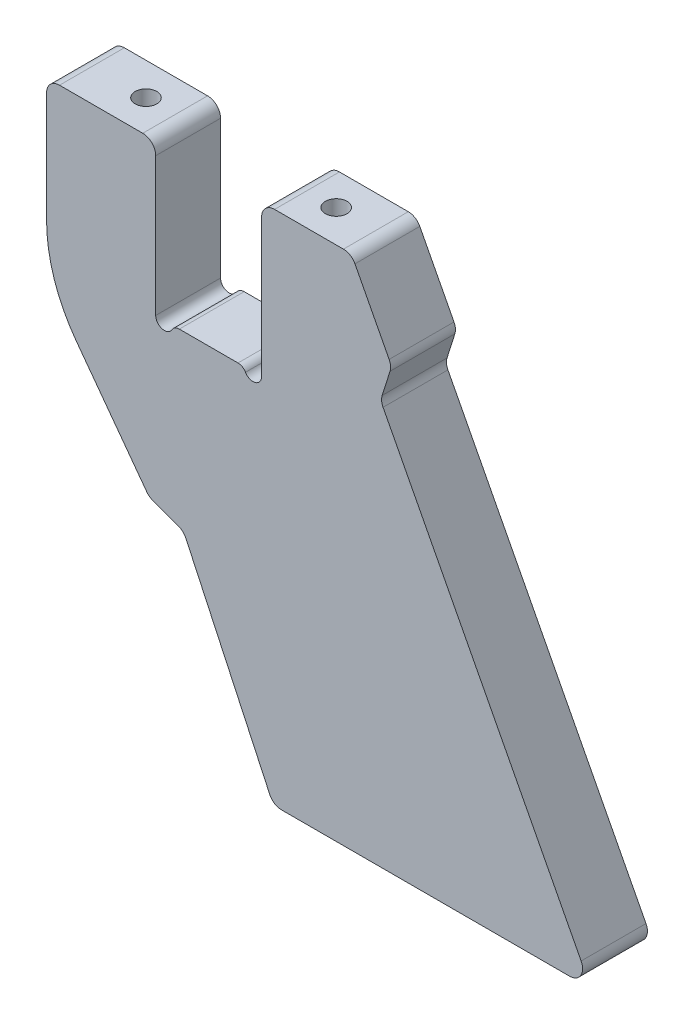
ISO-10303-21;
HEADER;
FILE_DESCRIPTION(('STEP AP214'),'2;1');
FILE_NAME('part.step','',(''),(''),'','','');
FILE_SCHEMA(('AUTOMOTIVE_DESIGN { 1 0 10303 214 1 1 1 1 }'));
ENDSEC;
DATA;
#1=APPLICATION_CONTEXT('core data for automotive mechanical design processes');
#2=APPLICATION_PROTOCOL_DEFINITION('international standard','automotive_design',2000,#1);
#3=PRODUCT_CONTEXT('',#1,'mechanical');
#4=PRODUCT('Part','Part','',(#3));
#5=PRODUCT_RELATED_PRODUCT_CATEGORY('part','',(#4));
#6=PRODUCT_DEFINITION_FORMATION('','',#4);
#7=PRODUCT_DEFINITION_CONTEXT('part definition',#1,'design');
#8=PRODUCT_DEFINITION('design','',#6,#7);
#9=PRODUCT_DEFINITION_SHAPE('','',#8);
#10=(LENGTH_UNIT() NAMED_UNIT(*) SI_UNIT(.MILLI.,.METRE.));
#11=(NAMED_UNIT(*) PLANE_ANGLE_UNIT() SI_UNIT($,.RADIAN.));
#12=(NAMED_UNIT(*) SI_UNIT($,.STERADIAN.) SOLID_ANGLE_UNIT());
#13=UNCERTAINTY_MEASURE_WITH_UNIT(LENGTH_MEASURE(1.E-05),#10,'distance_accuracy_value','');
#14=(GEOMETRIC_REPRESENTATION_CONTEXT(3) GLOBAL_UNCERTAINTY_ASSIGNED_CONTEXT((#13)) GLOBAL_UNIT_ASSIGNED_CONTEXT((#10,
#11,#12)) REPRESENTATION_CONTEXT('',''));
#15=CARTESIAN_POINT('',(0.,0.,0.));
#16=DIRECTION('',(0.,0.,1.));
#17=DIRECTION('',(1.,0.,0.));
#18=AXIS2_PLACEMENT_3D('',#15,#16,#17);
#19=CARTESIAN_POINT('',(31.1795553110562,32.,15.));
#20=DIRECTION('',(0.,0.,-1.));
#21=DIRECTION('',(-1.,0.,0.));
#22=AXIS2_PLACEMENT_3D('',#19,#20,#21);
#23=CYLINDRICAL_SURFACE('',#22,3.00000000000001);
#24=CARTESIAN_POINT('',(31.1795553110562,32.,0.));
#25=DIRECTION('',(0.,0.,1.));
#26=DIRECTION('',(1.,0.,0.));
#27=AXIS2_PLACEMENT_3D('',#24,#25,#26);
#28=CIRCLE('',#27,3.00000000000001);
#29=CARTESIAN_POINT('',(33.8405878105909,33.3852458397051,0.));
#30=VERTEX_POINT('',#29);
#31=CARTESIAN_POINT('',(31.1795553110562,35.,0.));
#32=VERTEX_POINT('',#31);
#33=EDGE_CURVE('E268',#30,#32,#28,.T.);
#34=ORIENTED_EDGE('',*,*,#33,.T.);
#35=DIRECTION('',(0.,0.,-1.));
#36=VECTOR('',#35,1.);
#37=CARTESIAN_POINT('',(31.1795553110562,35.,15.));
#38=LINE('',#37,#36);
#39=CARTESIAN_POINT('',(31.1795553110562,35.,15.));
#40=VERTEX_POINT('',#39);
#41=EDGE_CURVE('E11',#40,#32,#38,.T.);
#42=ORIENTED_EDGE('',*,*,#41,.F.);
#43=CARTESIAN_POINT('',(31.1795553110562,32.,15.));
#44=DIRECTION('',(0.,0.,1.));
#45=DIRECTION('',(1.,0.,0.));
#46=AXIS2_PLACEMENT_3D('',#43,#44,#45);
#47=CIRCLE('',#46,3.00000000000001);
#48=CARTESIAN_POINT('',(33.8405878105909,33.3852458397051,15.));
#49=VERTEX_POINT('',#48);
#50=EDGE_CURVE('E323',#49,#40,#47,.T.);
#51=ORIENTED_EDGE('',*,*,#50,.F.);
#52=DIRECTION('',(0.,0.,-1.));
#53=VECTOR('',#52,1.);
#54=CARTESIAN_POINT('',(33.8405878105909,33.3852458397051,15.));
#55=LINE('',#54,#53);
#56=EDGE_CURVE('E264',#49,#30,#55,.T.);
#57=ORIENTED_EDGE('',*,*,#56,.T.);
#58=EDGE_LOOP('',(#34,#42,#51,#57));
#59=FACE_BOUND('',#58,.T.);
#60=ADVANCED_FACE('F49',(#59),#23,.T.);
#61=CARTESIAN_POINT('',(15.25,35.,15.));
#62=DIRECTION('',(0.,-1.,0.));
#63=DIRECTION('',(1.,0.,0.));
#64=AXIS2_PLACEMENT_3D('',#61,#62,#63);
#65=PLANE('',#64);
#66=CARTESIAN_POINT('',(22.,35.,7.50000000000001));
#67=DIRECTION('',(0.,1.,0.));
#68=DIRECTION('',(0.,0.,1.));
#69=AXIS2_PLACEMENT_3D('',#66,#67,#68);
#70=CIRCLE('',#69,2.5);
#71=CARTESIAN_POINT('',(22.,35.,10.));
#72=VERTEX_POINT('',#71);
#73=EDGE_CURVE('E647',#72,#72,#70,.T.);
#74=ORIENTED_EDGE('',*,*,#73,.F.);
#75=EDGE_LOOP('',(#74));
#76=FACE_BOUND('',#75,.T.);
#77=DIRECTION('',(-1.,0.,0.));
#78=VECTOR('',#77,1.);
#79=CARTESIAN_POINT('',(15.25,35.,0.));
#80=LINE('',#79,#78);
#81=CARTESIAN_POINT('',(15.25,35.,0.));
#82=VERTEX_POINT('',#81);
#83=EDGE_CURVE('E271',#32,#82,#80,.T.);
#84=ORIENTED_EDGE('',*,*,#83,.T.);
#85=DIRECTION('',(0.,0.,-1.));
#86=VECTOR('',#85,1.);
#87=CARTESIAN_POINT('',(15.25,35.,15.));
#88=LINE('',#87,#86);
#89=CARTESIAN_POINT('',(15.25,35.,15.));
#90=VERTEX_POINT('',#89);
#91=EDGE_CURVE('E57',#90,#82,#88,.T.);
#92=ORIENTED_EDGE('',*,*,#91,.F.);
#93=DIRECTION('',(-1.,0.,0.));
#94=VECTOR('',#93,1.);
#95=CARTESIAN_POINT('',(15.25,35.,15.));
#96=LINE('',#95,#94);
#97=EDGE_CURVE('E169',#40,#90,#96,.T.);
#98=ORIENTED_EDGE('',*,*,#97,.F.);
#99=ORIENTED_EDGE('',*,*,#41,.T.);
#100=EDGE_LOOP('',(#84,#92,#98,#99));
#101=FACE_BOUND('',#100,.T.);
#102=ADVANCED_FACE('F481',(#76,#101),#65,.F.);
#103=CARTESIAN_POINT('',(15.25,32.,15.));
#104=DIRECTION('',(0.,0.,-1.));
#105=DIRECTION('',(-1.,0.,0.));
#106=AXIS2_PLACEMENT_3D('',#103,#104,#105);
#107=CYLINDRICAL_SURFACE('',#106,3.);
#108=CARTESIAN_POINT('',(15.25,32.,0.));
#109=DIRECTION('',(0.,0.,1.));
#110=DIRECTION('',(-1.,0.,0.));
#111=AXIS2_PLACEMENT_3D('',#108,#109,#110);
#112=CIRCLE('',#111,3.);
#113=CARTESIAN_POINT('',(12.25,32.,0.));
#114=VERTEX_POINT('',#113);
#115=EDGE_CURVE('E274',#82,#114,#112,.T.);
#116=ORIENTED_EDGE('',*,*,#115,.T.);
#117=DIRECTION('',(0.,0.,-1.));
#118=VECTOR('',#117,1.);
#119=CARTESIAN_POINT('',(12.25,32.,15.));
#120=LINE('',#119,#118);
#121=CARTESIAN_POINT('',(12.25,32.,15.));
#122=VERTEX_POINT('',#121);
#123=EDGE_CURVE('E390',#122,#114,#120,.T.);
#124=ORIENTED_EDGE('',*,*,#123,.F.);
#125=CARTESIAN_POINT('',(15.25,32.,15.));
#126=DIRECTION('',(0.,0.,1.));
#127=DIRECTION('',(-1.,0.,0.));
#128=AXIS2_PLACEMENT_3D('',#125,#126,#127);
#129=CIRCLE('',#128,3.);
#130=EDGE_CURVE('E398',#90,#122,#129,.T.);
#131=ORIENTED_EDGE('',*,*,#130,.F.);
#132=ORIENTED_EDGE('',*,*,#91,.T.);
#133=EDGE_LOOP('',(#116,#124,#131,#132));
#134=FACE_BOUND('',#133,.T.);
#135=ADVANCED_FACE('F396',(#134),#107,.T.);
#136=CARTESIAN_POINT('',(12.25,0.,15.));
#137=DIRECTION('',(1.,0.,0.));
#138=DIRECTION('',(0.,0.,-1.));
#139=AXIS2_PLACEMENT_3D('',#136,#137,#138);
#140=PLANE('',#139);
#141=DIRECTION('',(0.,-1.,0.));
#142=VECTOR('',#141,1.);
#143=CARTESIAN_POINT('',(12.25,0.,0.));
#144=LINE('',#143,#142);
#145=CARTESIAN_POINT('',(12.25,0.,0.));
#146=VERTEX_POINT('',#145);
#147=EDGE_CURVE('E276',#114,#146,#144,.T.);
#148=ORIENTED_EDGE('',*,*,#147,.T.);
#149=DIRECTION('',(0.,0.,-1.));
#150=VECTOR('',#149,1.);
#151=CARTESIAN_POINT('',(12.25,0.,15.));
#152=LINE('',#151,#150);
#153=CARTESIAN_POINT('',(12.25,0.,15.));
#154=VERTEX_POINT('',#153);
#155=EDGE_CURVE('E387',#154,#146,#152,.T.);
#156=ORIENTED_EDGE('',*,*,#155,.F.);
#157=DIRECTION('',(0.,-1.,0.));
#158=VECTOR('',#157,1.);
#159=CARTESIAN_POINT('',(12.25,0.,15.));
#160=LINE('',#159,#158);
#161=EDGE_CURVE('E416',#122,#154,#160,.T.);
#162=ORIENTED_EDGE('',*,*,#161,.F.);
#163=ORIENTED_EDGE('',*,*,#123,.T.);
#164=EDGE_LOOP('',(#148,#156,#162,#163));
#165=FACE_BOUND('',#164,.T.);
#166=ADVANCED_FACE('F407',(#165),#140,.F.);
#167=CARTESIAN_POINT('',(10.25,0.,15.));
#168=DIRECTION('',(0.,0.,-1.));
#169=DIRECTION('',(-1.,0.,0.));
#170=AXIS2_PLACEMENT_3D('',#167,#168,#169);
#171=CYLINDRICAL_SURFACE('',#170,2.);
#172=CARTESIAN_POINT('',(10.25,0.,0.));
#173=DIRECTION('',(0.,0.,-1.));
#174=DIRECTION('',(-1.,0.,0.));
#175=AXIS2_PLACEMENT_3D('',#172,#173,#174);
#176=CIRCLE('',#175,2.);
#177=CARTESIAN_POINT('',(8.51794919243112,-0.999999999999994,0.));
#178=VERTEX_POINT('',#177);
#179=EDGE_CURVE('E278',#146,#178,#176,.T.);
#180=ORIENTED_EDGE('',*,*,#179,.T.);
#181=DIRECTION('',(0.,0.,-1.));
#182=VECTOR('',#181,1.);
#183=CARTESIAN_POINT('',(8.51794919243112,-0.999999999999987,15.));
#184=LINE('',#183,#182);
#185=CARTESIAN_POINT('',(8.51794919243112,-0.999999999999987,15.));
#186=VERTEX_POINT('',#185);
#187=EDGE_CURVE('E384',#186,#178,#184,.T.);
#188=ORIENTED_EDGE('',*,*,#187,.F.);
#189=CARTESIAN_POINT('',(10.25,0.,15.));
#190=DIRECTION('',(0.,0.,-1.));
#191=DIRECTION('',(-1.,0.,0.));
#192=AXIS2_PLACEMENT_3D('',#189,#190,#191);
#193=CIRCLE('',#192,2.);
#194=EDGE_CURVE('E413',#154,#186,#193,.T.);
#195=ORIENTED_EDGE('',*,*,#194,.F.);
#196=ORIENTED_EDGE('',*,*,#155,.T.);
#197=EDGE_LOOP('',(#180,#188,#195,#196));
#198=FACE_BOUND('',#197,.T.);
#199=ADVANCED_FACE('F411',(#198),#171,.F.);
#200=CARTESIAN_POINT('',(6.78589838486225,-1.99999999999999,15.));
#201=DIRECTION('',(0.,0.,-1.));
#202=DIRECTION('',(-1.,0.,0.));
#203=AXIS2_PLACEMENT_3D('',#200,#201,#202);
#204=CYLINDRICAL_SURFACE('',#203,2.);
#205=CARTESIAN_POINT('',(6.78589838486225,-1.99999999999999,0.));
#206=DIRECTION('',(0.,0.,1.));
#207=DIRECTION('',(1.,0.,0.));
#208=AXIS2_PLACEMENT_3D('',#205,#206,#207);
#209=CIRCLE('',#208,2.);
#210=CARTESIAN_POINT('',(6.78589838486225,0.,0.));
#211=VERTEX_POINT('',#210);
#212=EDGE_CURVE('E280',#178,#211,#209,.T.);
#213=ORIENTED_EDGE('',*,*,#212,.T.);
#214=DIRECTION('',(0.,0.,-1.));
#215=VECTOR('',#214,1.);
#216=CARTESIAN_POINT('',(6.78589838486225,0.,15.));
#217=LINE('',#216,#215);
#218=CARTESIAN_POINT('',(6.78589838486225,0.,15.));
#219=VERTEX_POINT('',#218);
#220=EDGE_CURVE('E381',#219,#211,#217,.T.);
#221=ORIENTED_EDGE('',*,*,#220,.F.);
#222=CARTESIAN_POINT('',(6.78589838486225,-1.99999999999999,15.));
#223=DIRECTION('',(0.,0.,1.));
#224=DIRECTION('',(1.,0.,0.));
#225=AXIS2_PLACEMENT_3D('',#222,#223,#224);
#226=CIRCLE('',#225,2.);
#227=EDGE_CURVE('E415',#186,#219,#226,.T.);
#228=ORIENTED_EDGE('',*,*,#227,.F.);
#229=ORIENTED_EDGE('',*,*,#187,.T.);
#230=EDGE_LOOP('',(#213,#221,#228,#229));
#231=FACE_BOUND('',#230,.T.);
#232=ADVANCED_FACE('F496',(#231),#204,.T.);
#233=CARTESIAN_POINT('',(-6.78589838486224,0.,15.));
#234=DIRECTION('',(0.,-1.,0.));
#235=DIRECTION('',(0.,0.,-1.));
#236=AXIS2_PLACEMENT_3D('',#233,#234,#235);
#237=PLANE('',#236);
#238=DIRECTION('',(-1.,0.,0.));
#239=VECTOR('',#238,1.);
#240=CARTESIAN_POINT('',(-6.78589838486225,0.,0.));
#241=LINE('',#240,#239);
#242=CARTESIAN_POINT('',(-6.78589838486225,0.,0.));
#243=VERTEX_POINT('',#242);
#244=EDGE_CURVE('E282',#211,#243,#241,.T.);
#245=ORIENTED_EDGE('',*,*,#244,.T.);
#246=DIRECTION('',(0.,0.,-1.));
#247=VECTOR('',#246,1.);
#248=CARTESIAN_POINT('',(-6.78589838486224,0.,15.));
#249=LINE('',#248,#247);
#250=CARTESIAN_POINT('',(-6.78589838486224,0.,15.));
#251=VERTEX_POINT('',#250);
#252=EDGE_CURVE('E378',#251,#243,#249,.T.);
#253=ORIENTED_EDGE('',*,*,#252,.F.);
#254=DIRECTION('',(-1.,0.,0.));
#255=VECTOR('',#254,1.);
#256=CARTESIAN_POINT('',(-6.78589838486224,0.,15.));
#257=LINE('',#256,#255);
#258=EDGE_CURVE('E418',#219,#251,#257,.T.);
#259=ORIENTED_EDGE('',*,*,#258,.F.);
#260=ORIENTED_EDGE('',*,*,#220,.T.);
#261=EDGE_LOOP('',(#245,#253,#259,#260));
#262=FACE_BOUND('',#261,.T.);
#263=ADVANCED_FACE('F499',(#262),#237,.F.);
#264=CARTESIAN_POINT('',(-6.78589838486224,-1.99999999999999,15.));
#265=DIRECTION('',(0.,0.,-1.));
#266=DIRECTION('',(-1.,0.,0.));
#267=AXIS2_PLACEMENT_3D('',#264,#265,#266);
#268=CYLINDRICAL_SURFACE('',#267,2.);
#269=CARTESIAN_POINT('',(-6.78589838486225,-1.99999999999999,0.));
#270=DIRECTION('',(0.,0.,1.));
#271=DIRECTION('',(-1.,0.,0.));
#272=AXIS2_PLACEMENT_3D('',#269,#270,#271);
#273=CIRCLE('',#272,2.);
#274=CARTESIAN_POINT('',(-8.51794919243112,-0.999999999999994,0.));
#275=VERTEX_POINT('',#274);
#276=EDGE_CURVE('E284',#243,#275,#273,.T.);
#277=ORIENTED_EDGE('',*,*,#276,.T.);
#278=DIRECTION('',(0.,0.,-1.));
#279=VECTOR('',#278,1.);
#280=CARTESIAN_POINT('',(-8.51794919243112,-0.999999999999987,15.));
#281=LINE('',#280,#279);
#282=CARTESIAN_POINT('',(-8.51794919243112,-0.999999999999987,15.));
#283=VERTEX_POINT('',#282);
#284=EDGE_CURVE('E375',#283,#275,#281,.T.);
#285=ORIENTED_EDGE('',*,*,#284,.F.);
#286=CARTESIAN_POINT('',(-6.78589838486224,-1.99999999999999,15.));
#287=DIRECTION('',(0.,0.,1.));
#288=DIRECTION('',(-1.,0.,0.));
#289=AXIS2_PLACEMENT_3D('',#286,#287,#288);
#290=CIRCLE('',#289,2.);
#291=EDGE_CURVE('E424',#251,#283,#290,.T.);
#292=ORIENTED_EDGE('',*,*,#291,.F.);
#293=ORIENTED_EDGE('',*,*,#252,.T.);
#294=EDGE_LOOP('',(#277,#285,#292,#293));
#295=FACE_BOUND('',#294,.T.);
#296=ADVANCED_FACE('F503',(#295),#268,.T.);
#297=CARTESIAN_POINT('',(-10.25,0.,15.));
#298=DIRECTION('',(0.,0.,-1.));
#299=DIRECTION('',(-1.,0.,0.));
#300=AXIS2_PLACEMENT_3D('',#297,#298,#299);
#301=CYLINDRICAL_SURFACE('',#300,2.);
#302=CARTESIAN_POINT('',(-10.25,0.,0.));
#303=DIRECTION('',(0.,0.,-1.));
#304=DIRECTION('',(1.,0.,0.));
#305=AXIS2_PLACEMENT_3D('',#302,#303,#304);
#306=CIRCLE('',#305,2.);
#307=CARTESIAN_POINT('',(-12.25,0.,0.));
#308=VERTEX_POINT('',#307);
#309=EDGE_CURVE('E286',#275,#308,#306,.T.);
#310=ORIENTED_EDGE('',*,*,#309,.T.);
#311=DIRECTION('',(0.,0.,-1.));
#312=VECTOR('',#311,1.);
#313=CARTESIAN_POINT('',(-12.25,0.,15.));
#314=LINE('',#313,#312);
#315=CARTESIAN_POINT('',(-12.25,0.,15.));
#316=VERTEX_POINT('',#315);
#317=EDGE_CURVE('E372',#316,#308,#314,.T.);
#318=ORIENTED_EDGE('',*,*,#317,.F.);
#319=CARTESIAN_POINT('',(-10.25,0.,15.));
#320=DIRECTION('',(0.,0.,-1.));
#321=DIRECTION('',(1.,0.,0.));
#322=AXIS2_PLACEMENT_3D('',#319,#320,#321);
#323=CIRCLE('',#322,2.);
#324=EDGE_CURVE('E426',#283,#316,#323,.T.);
#325=ORIENTED_EDGE('',*,*,#324,.F.);
#326=ORIENTED_EDGE('',*,*,#284,.T.);
#327=EDGE_LOOP('',(#310,#318,#325,#326));
#328=FACE_BOUND('',#327,.T.);
#329=ADVANCED_FACE('F507',(#328),#301,.F.);
#330=CARTESIAN_POINT('',(-12.25,0.,15.));
#331=DIRECTION('',(-1.,0.,0.));
#332=DIRECTION('',(0.,0.,1.));
#333=AXIS2_PLACEMENT_3D('',#330,#331,#332);
#334=PLANE('',#333);
#335=DIRECTION('',(0.,1.,0.));
#336=VECTOR('',#335,1.);
#337=CARTESIAN_POINT('',(-12.25,0.,0.));
#338=LINE('',#337,#336);
#339=CARTESIAN_POINT('',(-12.25,32.,0.));
#340=VERTEX_POINT('',#339);
#341=EDGE_CURVE('E288',#308,#340,#338,.T.);
#342=ORIENTED_EDGE('',*,*,#341,.T.);
#343=DIRECTION('',(0.,0.,-1.));
#344=VECTOR('',#343,1.);
#345=CARTESIAN_POINT('',(-12.25,32.,15.));
#346=LINE('',#345,#344);
#347=CARTESIAN_POINT('',(-12.25,32.,15.));
#348=VERTEX_POINT('',#347);
#349=EDGE_CURVE('E369',#348,#340,#346,.T.);
#350=ORIENTED_EDGE('',*,*,#349,.F.);
#351=DIRECTION('',(0.,1.,0.));
#352=VECTOR('',#351,1.);
#353=CARTESIAN_POINT('',(-12.25,0.,15.));
#354=LINE('',#353,#352);
#355=EDGE_CURVE('E428',#316,#348,#354,.T.);
#356=ORIENTED_EDGE('',*,*,#355,.F.);
#357=ORIENTED_EDGE('',*,*,#317,.T.);
#358=EDGE_LOOP('',(#342,#350,#356,#357));
#359=FACE_BOUND('',#358,.T.);
#360=ADVANCED_FACE('F511',(#359),#334,.F.);
#361=CARTESIAN_POINT('',(-15.25,32.,15.));
#362=DIRECTION('',(0.,0.,-1.));
#363=DIRECTION('',(-1.,0.,0.));
#364=AXIS2_PLACEMENT_3D('',#361,#362,#363);
#365=CYLINDRICAL_SURFACE('',#364,3.);
#366=CARTESIAN_POINT('',(-15.25,32.,0.));
#367=DIRECTION('',(0.,0.,1.));
#368=DIRECTION('',(-1.,0.,0.));
#369=AXIS2_PLACEMENT_3D('',#366,#367,#368);
#370=CIRCLE('',#369,3.);
#371=CARTESIAN_POINT('',(-15.25,35.,0.));
#372=VERTEX_POINT('',#371);
#373=EDGE_CURVE('E290',#340,#372,#370,.T.);
#374=ORIENTED_EDGE('',*,*,#373,.T.);
#375=DIRECTION('',(0.,0.,-1.));
#376=VECTOR('',#375,1.);
#377=CARTESIAN_POINT('',(-15.25,35.,15.));
#378=LINE('',#377,#376);
#379=CARTESIAN_POINT('',(-15.25,35.,15.));
#380=VERTEX_POINT('',#379);
#381=EDGE_CURVE('E366',#380,#372,#378,.T.);
#382=ORIENTED_EDGE('',*,*,#381,.F.);
#383=CARTESIAN_POINT('',(-15.25,32.,15.));
#384=DIRECTION('',(0.,0.,1.));
#385=DIRECTION('',(-1.,0.,0.));
#386=AXIS2_PLACEMENT_3D('',#383,#384,#385);
#387=CIRCLE('',#386,3.);
#388=EDGE_CURVE('E430',#348,#380,#387,.T.);
#389=ORIENTED_EDGE('',*,*,#388,.F.);
#390=ORIENTED_EDGE('',*,*,#349,.T.);
#391=EDGE_LOOP('',(#374,#382,#389,#390));
#392=FACE_BOUND('',#391,.T.);
#393=ADVANCED_FACE('F515',(#392),#365,.T.);
#394=CARTESIAN_POINT('',(-15.25,35.,15.));
#395=DIRECTION('',(0.,-1.,0.));
#396=DIRECTION('',(1.,0.,0.));
#397=AXIS2_PLACEMENT_3D('',#394,#395,#396);
#398=PLANE('',#397);
#399=CARTESIAN_POINT('',(-22.,35.,7.49999999999999));
#400=DIRECTION('',(0.,1.,0.));
#401=DIRECTION('',(0.,0.,1.));
#402=AXIS2_PLACEMENT_3D('',#399,#400,#401);
#403=CIRCLE('',#402,2.5);
#404=CARTESIAN_POINT('',(-22.,35.,9.99999999999999));
#405=VERTEX_POINT('',#404);
#406=EDGE_CURVE('E649',#405,#405,#403,.T.);
#407=ORIENTED_EDGE('',*,*,#406,.F.);
#408=EDGE_LOOP('',(#407));
#409=FACE_BOUND('',#408,.T.);
#410=DIRECTION('',(-1.,0.,0.));
#411=VECTOR('',#410,1.);
#412=CARTESIAN_POINT('',(-15.25,35.,0.));
#413=LINE('',#412,#411);
#414=CARTESIAN_POINT('',(-34.5,35.,0.));
#415=VERTEX_POINT('',#414);
#416=EDGE_CURVE('E292',#372,#415,#413,.T.);
#417=ORIENTED_EDGE('',*,*,#416,.T.);
#418=DIRECTION('',(0.,0.,-1.));
#419=VECTOR('',#418,1.);
#420=CARTESIAN_POINT('',(-34.5,35.,15.));
#421=LINE('',#420,#419);
#422=CARTESIAN_POINT('',(-34.5,35.,15.));
#423=VERTEX_POINT('',#422);
#424=EDGE_CURVE('E363',#423,#415,#421,.T.);
#425=ORIENTED_EDGE('',*,*,#424,.F.);
#426=DIRECTION('',(-1.,0.,0.));
#427=VECTOR('',#426,1.);
#428=CARTESIAN_POINT('',(-15.25,35.,15.));
#429=LINE('',#428,#427);
#430=EDGE_CURVE('E432',#380,#423,#429,.T.);
#431=ORIENTED_EDGE('',*,*,#430,.F.);
#432=ORIENTED_EDGE('',*,*,#381,.T.);
#433=EDGE_LOOP('',(#417,#425,#431,#432));
#434=FACE_BOUND('',#433,.T.);
#435=ADVANCED_FACE('F519',(#409,#434),#398,.F.);
#436=CARTESIAN_POINT('',(-34.5,32.,15.));
#437=DIRECTION('',(0.,0.,-1.));
#438=DIRECTION('',(-1.,0.,0.));
#439=AXIS2_PLACEMENT_3D('',#436,#437,#438);
#440=CYLINDRICAL_SURFACE('',#439,3.);
#441=CARTESIAN_POINT('',(-34.5,32.,0.));
#442=DIRECTION('',(0.,0.,1.));
#443=DIRECTION('',(-1.,0.,0.));
#444=AXIS2_PLACEMENT_3D('',#441,#442,#443);
#445=CIRCLE('',#444,3.);
#446=CARTESIAN_POINT('',(-37.5,32.,0.));
#447=VERTEX_POINT('',#446);
#448=EDGE_CURVE('E294',#415,#447,#445,.T.);
#449=ORIENTED_EDGE('',*,*,#448,.T.);
#450=DIRECTION('',(0.,0.,-1.));
#451=VECTOR('',#450,1.);
#452=CARTESIAN_POINT('',(-37.5,32.,15.));
#453=LINE('',#452,#451);
#454=CARTESIAN_POINT('',(-37.5,32.,15.));
#455=VERTEX_POINT('',#454);
#456=EDGE_CURVE('E360',#455,#447,#453,.T.);
#457=ORIENTED_EDGE('',*,*,#456,.F.);
#458=CARTESIAN_POINT('',(-34.5,32.,15.));
#459=DIRECTION('',(0.,0.,1.));
#460=DIRECTION('',(-1.,0.,0.));
#461=AXIS2_PLACEMENT_3D('',#458,#459,#460);
#462=CIRCLE('',#461,3.);
#463=EDGE_CURVE('E434',#423,#455,#462,.T.);
#464=ORIENTED_EDGE('',*,*,#463,.F.);
#465=ORIENTED_EDGE('',*,*,#424,.T.);
#466=EDGE_LOOP('',(#449,#457,#464,#465));
#467=FACE_BOUND('',#466,.T.);
#468=ADVANCED_FACE('F523',(#467),#440,.T.);
#469=CARTESIAN_POINT('',(-37.5,6.52878625967986,15.));
#470=DIRECTION('',(1.,0.,0.));
#471=DIRECTION('',(0.,0.,-1.));
#472=AXIS2_PLACEMENT_3D('',#469,#470,#471);
#473=PLANE('',#472);
#474=DIRECTION('',(0.,-1.,0.));
#475=VECTOR('',#474,1.);
#476=CARTESIAN_POINT('',(-37.5,6.52878625967986,0.));
#477=LINE('',#476,#475);
#478=CARTESIAN_POINT('',(-37.5,6.52878625967986,0.));
#479=VERTEX_POINT('',#478);
#480=EDGE_CURVE('E296',#447,#479,#477,.T.);
#481=ORIENTED_EDGE('',*,*,#480,.T.);
#482=DIRECTION('',(0.,0.,-1.));
#483=VECTOR('',#482,1.);
#484=CARTESIAN_POINT('',(-37.5,6.52878625967986,15.));
#485=LINE('',#484,#483);
#486=CARTESIAN_POINT('',(-37.5,6.52878625967986,15.));
#487=VERTEX_POINT('',#486);
#488=EDGE_CURVE('E357',#487,#479,#485,.T.);
#489=ORIENTED_EDGE('',*,*,#488,.F.);
#490=DIRECTION('',(0.,-1.,0.));
#491=VECTOR('',#490,1.);
#492=CARTESIAN_POINT('',(-37.5,6.52878625967986,15.));
#493=LINE('',#492,#491);
#494=EDGE_CURVE('E436',#455,#487,#493,.T.);
#495=ORIENTED_EDGE('',*,*,#494,.F.);
#496=ORIENTED_EDGE('',*,*,#456,.T.);
#497=EDGE_LOOP('',(#481,#489,#495,#496));
#498=FACE_BOUND('',#497,.T.);
#499=ADVANCED_FACE('F527',(#498),#473,.F.);
#500=CARTESIAN_POINT('',(-2.5,6.52878625967986,15.));
#501=DIRECTION('',(0.,0.,-1.));
#502=DIRECTION('',(-1.,0.,0.));
#503=AXIS2_PLACEMENT_3D('',#500,#501,#502);
#504=CYLINDRICAL_SURFACE('',#503,35.);
#505=CARTESIAN_POINT('',(-2.49999999999999,6.52878625967986,0.));
#506=DIRECTION('',(0.,0.,1.));
#507=DIRECTION('',(-1.,0.,0.));
#508=AXIS2_PLACEMENT_3D('',#505,#506,#507);
#509=CIRCLE('',#508,35.);
#510=CARTESIAN_POINT('',(-30.6483795484822,-14.2719043248798,0.));
#511=VERTEX_POINT('',#510);
#512=EDGE_CURVE('E298',#479,#511,#509,.T.);
#513=ORIENTED_EDGE('',*,*,#512,.T.);
#514=DIRECTION('',(0.,0.,-1.));
#515=VECTOR('',#514,1.);
#516=CARTESIAN_POINT('',(-30.6483795484822,-14.2719043248798,15.));
#517=LINE('',#516,#515);
#518=CARTESIAN_POINT('',(-30.6483795484822,-14.2719043248798,15.));
#519=VERTEX_POINT('',#518);
#520=EDGE_CURVE('E354',#519,#511,#517,.T.);
#521=ORIENTED_EDGE('',*,*,#520,.F.);
#522=CARTESIAN_POINT('',(-2.5,6.52878625967986,15.));
#523=DIRECTION('',(0.,0.,1.));
#524=DIRECTION('',(-1.,0.,0.));
#525=AXIS2_PLACEMENT_3D('',#522,#523,#524);
#526=CIRCLE('',#525,35.);
#527=EDGE_CURVE('E438',#487,#519,#526,.T.);
#528=ORIENTED_EDGE('',*,*,#527,.F.);
#529=ORIENTED_EDGE('',*,*,#488,.T.);
#530=EDGE_LOOP('',(#513,#521,#528,#529));
#531=FACE_BOUND('',#530,.T.);
#532=ADVANCED_FACE('F531',(#531),#504,.T.);
#533=CARTESIAN_POINT('',(-30.6483795484822,-14.2719043248798,15.));
#534=DIRECTION('',(0.804239415670919,0.594305445273134,0.));
#535=DIRECTION('',(-0.594305445273134,0.804239415670919,0.));
#536=AXIS2_PLACEMENT_3D('',#533,#534,#535);
#537=PLANE('',#536);
#538=DIRECTION('',(0.594305445273134,-0.804239415670919,0.));
#539=VECTOR('',#538,1.);
#540=CARTESIAN_POINT('',(-30.6483795484822,-14.2719043248798,0.));
#541=LINE('',#540,#539);
#542=CARTESIAN_POINT('',(-14.3179987308344,-36.3708704893791,0.));
#543=VERTEX_POINT('',#542);
#544=EDGE_CURVE('E300',#511,#543,#541,.T.);
#545=ORIENTED_EDGE('',*,*,#544,.T.);
#546=DIRECTION('',(0.,0.,-1.));
#547=VECTOR('',#546,1.);
#548=CARTESIAN_POINT('',(-14.3179987308344,-36.3708704893791,15.));
#549=LINE('',#548,#547);
#550=CARTESIAN_POINT('',(-14.3179987308344,-36.3708704893791,15.));
#551=VERTEX_POINT('',#550);
#552=EDGE_CURVE('E351',#551,#543,#549,.T.);
#553=ORIENTED_EDGE('',*,*,#552,.F.);
#554=DIRECTION('',(0.594305445273134,-0.804239415670919,0.));
#555=VECTOR('',#554,1.);
#556=CARTESIAN_POINT('',(-30.6483795484822,-14.2719043248798,15.));
#557=LINE('',#556,#555);
#558=EDGE_CURVE('E440',#519,#551,#557,.T.);
#559=ORIENTED_EDGE('',*,*,#558,.F.);
#560=ORIENTED_EDGE('',*,*,#520,.T.);
#561=EDGE_LOOP('',(#545,#553,#559,#560));
#562=FACE_BOUND('',#561,.T.);
#563=ADVANCED_FACE('F535',(#562),#537,.F.);
#564=CARTESIAN_POINT('',(-11.9052804838217,-34.5879541535597,15.));
#565=DIRECTION('',(0.,0.,-1.));
#566=DIRECTION('',(-1.,0.,0.));
#567=AXIS2_PLACEMENT_3D('',#564,#565,#566);
#568=CYLINDRICAL_SURFACE('',#567,3.);
#569=CARTESIAN_POINT('',(-11.9052804838217,-34.5879541535597,0.));
#570=DIRECTION('',(0.,0.,1.));
#571=DIRECTION('',(-1.,0.,0.));
#572=AXIS2_PLACEMENT_3D('',#569,#570,#571);
#573=CIRCLE('',#572,3.);
#574=CARTESIAN_POINT('',(-12.9313409137986,-37.4070320159174,0.));
#575=VERTEX_POINT('',#574);
#576=EDGE_CURVE('E302',#543,#575,#573,.T.);
#577=ORIENTED_EDGE('',*,*,#576,.T.);
#578=DIRECTION('',(0.,0.,-1.));
#579=VECTOR('',#578,1.);
#580=CARTESIAN_POINT('',(-12.9313409137987,-37.4070320159174,15.));
#581=LINE('',#580,#579);
#582=CARTESIAN_POINT('',(-12.9313409137987,-37.4070320159174,15.));
#583=VERTEX_POINT('',#582);
#584=EDGE_CURVE('E348',#583,#575,#581,.T.);
#585=ORIENTED_EDGE('',*,*,#584,.F.);
#586=CARTESIAN_POINT('',(-11.9052804838217,-34.5879541535597,15.));
#587=DIRECTION('',(0.,0.,1.));
#588=DIRECTION('',(-1.,0.,0.));
#589=AXIS2_PLACEMENT_3D('',#586,#587,#588);
#590=CIRCLE('',#589,3.);
#591=EDGE_CURVE('E442',#551,#583,#590,.T.);
#592=ORIENTED_EDGE('',*,*,#591,.F.);
#593=ORIENTED_EDGE('',*,*,#552,.T.);
#594=EDGE_LOOP('',(#577,#585,#592,#593));
#595=FACE_BOUND('',#594,.T.);
#596=ADVANCED_FACE('F539',(#595),#568,.T.);
#597=CARTESIAN_POINT('',(-6.97492021213714,-39.5749918540891,15.));
#598=DIRECTION('',(0.342020143325665,0.93969262078591,0.));
#599=DIRECTION('',(-0.93969262078591,0.342020143325665,0.));
#600=AXIS2_PLACEMENT_3D('',#597,#598,#599);
#601=PLANE('',#600);
#602=DIRECTION('',(0.93969262078591,-0.342020143325665,0.));
#603=VECTOR('',#602,1.);
#604=CARTESIAN_POINT('',(-6.97492021213714,-39.5749918540891,0.));
#605=LINE('',#604,#603);
#606=CARTESIAN_POINT('',(-6.97492021213714,-39.5749918540891,0.));
#607=VERTEX_POINT('',#606);
#608=EDGE_CURVE('E304',#575,#607,#605,.T.);
#609=ORIENTED_EDGE('',*,*,#608,.T.);
#610=DIRECTION('',(0.,0.,-1.));
#611=VECTOR('',#610,1.);
#612=CARTESIAN_POINT('',(-6.97492021213714,-39.5749918540891,15.));
#613=LINE('',#612,#611);
#614=CARTESIAN_POINT('',(-6.97492021213714,-39.5749918540891,15.));
#615=VERTEX_POINT('',#614);
#616=EDGE_CURVE('E345',#615,#607,#613,.T.);
#617=ORIENTED_EDGE('',*,*,#616,.F.);
#618=DIRECTION('',(0.93969262078591,-0.342020143325665,0.));
#619=VECTOR('',#618,1.);
#620=CARTESIAN_POINT('',(-6.97492021213714,-39.5749918540891,15.));
#621=LINE('',#620,#619);
#622=EDGE_CURVE('E444',#583,#615,#621,.T.);
#623=ORIENTED_EDGE('',*,*,#622,.F.);
#624=ORIENTED_EDGE('',*,*,#584,.T.);
#625=EDGE_LOOP('',(#609,#617,#623,#624));
#626=FACE_BOUND('',#625,.T.);
#627=ADVANCED_FACE('F543',(#626),#601,.F.);
#628=CARTESIAN_POINT('',(-8.00098064211413,-42.3940697164469,15.));
#629=DIRECTION('',(0.,0.,-1.));
#630=DIRECTION('',(-1.,0.,0.));
#631=AXIS2_PLACEMENT_3D('',#628,#629,#630);
#632=CYLINDRICAL_SURFACE('',#631,3.);
#633=CARTESIAN_POINT('',(-8.00098064211413,-42.3940697164469,0.));
#634=DIRECTION('',(0.,0.,-1.));
#635=DIRECTION('',(-1.,0.,0.));
#636=AXIS2_PLACEMENT_3D('',#633,#634,#635);
#637=CIRCLE('',#636,3.);
#638=CARTESIAN_POINT('',(-5.28205728100419,-41.1262149312248,0.));
#639=VERTEX_POINT('',#638);
#640=EDGE_CURVE('E306',#607,#639,#637,.T.);
#641=ORIENTED_EDGE('',*,*,#640,.T.);
#642=DIRECTION('',(0.,0.,-1.));
#643=VECTOR('',#642,1.);
#644=CARTESIAN_POINT('',(-5.28205728100417,-41.1262149312248,15.));
#645=LINE('',#644,#643);
#646=CARTESIAN_POINT('',(-5.28205728100417,-41.1262149312248,15.));
#647=VERTEX_POINT('',#646);
#648=EDGE_CURVE('E342',#647,#639,#645,.T.);
#649=ORIENTED_EDGE('',*,*,#648,.F.);
#650=CARTESIAN_POINT('',(-8.00098064211413,-42.3940697164469,15.));
#651=DIRECTION('',(0.,0.,-1.));
#652=DIRECTION('',(-1.,0.,0.));
#653=AXIS2_PLACEMENT_3D('',#650,#651,#652);
#654=CIRCLE('',#653,3.);
#655=EDGE_CURVE('E446',#615,#647,#654,.T.);
#656=ORIENTED_EDGE('',*,*,#655,.F.);
#657=ORIENTED_EDGE('',*,*,#616,.T.);
#658=EDGE_LOOP('',(#641,#649,#656,#657));
#659=FACE_BOUND('',#658,.T.);
#660=ADVANCED_FACE('F547',(#659),#632,.F.);
#661=CARTESIAN_POINT('',(14.1357582810473,-82.7678547852221,15.));
#662=DIRECTION('',(0.906307787036649,0.422618261740702,0.));
#663=DIRECTION('',(-0.422618261740701,0.906307787036649,0.));
#664=AXIS2_PLACEMENT_3D('',#661,#662,#663);
#665=PLANE('',#664);
#666=DIRECTION('',(0.422618261740701,-0.906307787036649,0.));
#667=VECTOR('',#666,1.);
#668=CARTESIAN_POINT('',(14.1357582810473,-82.7678547852221,0.));
#669=LINE('',#668,#667);
#670=CARTESIAN_POINT('',(14.1357582810473,-82.7678547852221,0.));
#671=VERTEX_POINT('',#670);
#672=EDGE_CURVE('E308',#639,#671,#669,.T.);
#673=ORIENTED_EDGE('',*,*,#672,.T.);
#674=DIRECTION('',(0.,0.,-1.));
#675=VECTOR('',#674,1.);
#676=CARTESIAN_POINT('',(14.1357582810473,-82.7678547852221,15.));
#677=LINE('',#676,#675);
#678=CARTESIAN_POINT('',(14.1357582810473,-82.7678547852221,15.));
#679=VERTEX_POINT('',#678);
#680=EDGE_CURVE('E339',#679,#671,#677,.T.);
#681=ORIENTED_EDGE('',*,*,#680,.F.);
#682=DIRECTION('',(0.422618261740701,-0.906307787036649,0.));
#683=VECTOR('',#682,1.);
#684=CARTESIAN_POINT('',(14.1357582810473,-82.7678547852221,15.));
#685=LINE('',#684,#683);
#686=EDGE_CURVE('E448',#647,#679,#685,.T.);
#687=ORIENTED_EDGE('',*,*,#686,.F.);
#688=ORIENTED_EDGE('',*,*,#648,.T.);
#689=EDGE_LOOP('',(#673,#681,#687,#688));
#690=FACE_BOUND('',#689,.T.);
#691=ADVANCED_FACE('F551',(#690),#665,.F.);
#692=CARTESIAN_POINT('',(16.8546816421572,-81.5,15.));
#693=DIRECTION('',(0.,0.,-1.));
#694=DIRECTION('',(-1.,0.,0.));
#695=AXIS2_PLACEMENT_3D('',#692,#693,#694);
#696=CYLINDRICAL_SURFACE('',#695,3.);
#697=CARTESIAN_POINT('',(16.8546816421572,-81.5,0.));
#698=DIRECTION('',(0.,0.,1.));
#699=DIRECTION('',(-1.,0.,0.));
#700=AXIS2_PLACEMENT_3D('',#697,#698,#699);
#701=CIRCLE('',#700,3.);
#702=CARTESIAN_POINT('',(16.8546816421572,-84.5,0.));
#703=VERTEX_POINT('',#702);
#704=EDGE_CURVE('E310',#671,#703,#701,.T.);
#705=ORIENTED_EDGE('',*,*,#704,.T.);
#706=DIRECTION('',(0.,0.,-1.));
#707=VECTOR('',#706,1.);
#708=CARTESIAN_POINT('',(16.8546816421572,-84.5,15.));
#709=LINE('',#708,#707);
#710=CARTESIAN_POINT('',(16.8546816421572,-84.5,15.));
#711=VERTEX_POINT('',#710);
#712=EDGE_CURVE('E336',#711,#703,#709,.T.);
#713=ORIENTED_EDGE('',*,*,#712,.F.);
#714=CARTESIAN_POINT('',(16.8546816421572,-81.5,15.));
#715=DIRECTION('',(0.,0.,1.));
#716=DIRECTION('',(-1.,0.,0.));
#717=AXIS2_PLACEMENT_3D('',#714,#715,#716);
#718=CIRCLE('',#717,3.);
#719=EDGE_CURVE('E450',#679,#711,#718,.T.);
#720=ORIENTED_EDGE('',*,*,#719,.F.);
#721=ORIENTED_EDGE('',*,*,#680,.T.);
#722=EDGE_LOOP('',(#705,#713,#720,#721));
#723=FACE_BOUND('',#722,.T.);
#724=ADVANCED_FACE('F555',(#723),#696,.T.);
#725=CARTESIAN_POINT('',(83.4996238674805,-84.5,15.));
#726=DIRECTION('',(0.,1.,0.));
#727=DIRECTION('',(-1.,0.,0.));
#728=AXIS2_PLACEMENT_3D('',#725,#726,#727);
#729=PLANE('',#728);
#730=DIRECTION('',(1.,0.,0.));
#731=VECTOR('',#730,1.);
#732=CARTESIAN_POINT('',(83.4996238674805,-84.5,0.));
#733=LINE('',#732,#731);
#734=CARTESIAN_POINT('',(83.4996238674805,-84.5,0.));
#735=VERTEX_POINT('',#734);
#736=EDGE_CURVE('E312',#703,#735,#733,.T.);
#737=ORIENTED_EDGE('',*,*,#736,.T.);
#738=DIRECTION('',(0.,0.,-1.));
#739=VECTOR('',#738,1.);
#740=CARTESIAN_POINT('',(83.4996238674805,-84.5,15.));
#741=LINE('',#740,#739);
#742=CARTESIAN_POINT('',(83.4996238674805,-84.5,15.));
#743=VERTEX_POINT('',#742);
#744=EDGE_CURVE('E333',#743,#735,#741,.T.);
#745=ORIENTED_EDGE('',*,*,#744,.F.);
#746=DIRECTION('',(1.,0.,0.));
#747=VECTOR('',#746,1.);
#748=CARTESIAN_POINT('',(83.4996238674805,-84.5,15.));
#749=LINE('',#748,#747);
#750=EDGE_CURVE('E452',#711,#743,#749,.T.);
#751=ORIENTED_EDGE('',*,*,#750,.F.);
#752=ORIENTED_EDGE('',*,*,#712,.T.);
#753=EDGE_LOOP('',(#737,#745,#751,#752));
#754=FACE_BOUND('',#753,.T.);
#755=ADVANCED_FACE('F559',(#754),#729,.F.);
#756=CARTESIAN_POINT('',(83.4996238674805,-81.5,15.));
#757=DIRECTION('',(0.,0.,-1.));
#758=DIRECTION('',(-1.,0.,0.));
#759=AXIS2_PLACEMENT_3D('',#756,#757,#758);
#760=CYLINDRICAL_SURFACE('',#759,2.99999999999999);
#761=CARTESIAN_POINT('',(83.4996238674805,-81.5,0.));
#762=DIRECTION('',(0.,0.,1.));
#763=DIRECTION('',(-1.,0.,0.));
#764=AXIS2_PLACEMENT_3D('',#761,#762,#763);
#765=CIRCLE('',#764,2.99999999999999);
#766=CARTESIAN_POINT('',(86.1606563670152,-80.1147541602949,0.));
#767=VERTEX_POINT('',#766);
#768=EDGE_CURVE('E314',#735,#767,#765,.T.);
#769=ORIENTED_EDGE('',*,*,#768,.T.);
#770=DIRECTION('',(0.,0.,-1.));
#771=VECTOR('',#770,1.);
#772=CARTESIAN_POINT('',(86.1606563670152,-80.1147541602949,15.));
#773=LINE('',#772,#771);
#774=CARTESIAN_POINT('',(86.1606563670152,-80.1147541602949,15.));
#775=VERTEX_POINT('',#774);
#776=EDGE_CURVE('E330',#775,#767,#773,.T.);
#777=ORIENTED_EDGE('',*,*,#776,.F.);
#778=CARTESIAN_POINT('',(83.4996238674805,-81.5,15.));
#779=DIRECTION('',(0.,0.,1.));
#780=DIRECTION('',(-1.,0.,0.));
#781=AXIS2_PLACEMENT_3D('',#778,#779,#780);
#782=CIRCLE('',#781,2.99999999999999);
#783=EDGE_CURVE('E454',#743,#775,#782,.T.);
#784=ORIENTED_EDGE('',*,*,#783,.F.);
#785=ORIENTED_EDGE('',*,*,#744,.T.);
#786=EDGE_LOOP('',(#769,#777,#784,#785));
#787=FACE_BOUND('',#786,.T.);
#788=ADVANCED_FACE('F563',(#787),#760,.T.);
#789=CARTESIAN_POINT('',(40.3442392471739,7.89776424877718,15.));
#790=DIRECTION('',(-0.887010833178224,-0.461748613235029,0.));
#791=DIRECTION('',(0.461748613235029,-0.887010833178224,0.));
#792=AXIS2_PLACEMENT_3D('',#789,#790,#791);
#793=PLANE('',#792);
#794=DIRECTION('',(-0.461748613235029,0.887010833178224,0.));
#795=VECTOR('',#794,1.);
#796=CARTESIAN_POINT('',(40.3442392471739,7.89776424877718,0.));
#797=LINE('',#796,#795);
#798=CARTESIAN_POINT('',(40.3442392471739,7.89776424877718,0.));
#799=VERTEX_POINT('',#798);
#800=EDGE_CURVE('E316',#767,#799,#797,.T.);
#801=ORIENTED_EDGE('',*,*,#800,.T.);
#802=DIRECTION('',(0.,0.,-1.));
#803=VECTOR('',#802,1.);
#804=CARTESIAN_POINT('',(40.3442392471739,7.89776424877718,15.));
#805=LINE('',#804,#803);
#806=CARTESIAN_POINT('',(40.3442392471739,7.89776424877718,15.));
#807=VERTEX_POINT('',#806);
#808=EDGE_CURVE('E327',#807,#799,#805,.T.);
#809=ORIENTED_EDGE('',*,*,#808,.F.);
#810=DIRECTION('',(-0.461748613235029,0.887010833178224,0.));
#811=VECTOR('',#810,1.);
#812=CARTESIAN_POINT('',(40.3442392471739,7.89776424877718,15.));
#813=LINE('',#812,#811);
#814=EDGE_CURVE('E456',#775,#807,#813,.T.);
#815=ORIENTED_EDGE('',*,*,#814,.F.);
#816=ORIENTED_EDGE('',*,*,#776,.T.);
#817=EDGE_LOOP('',(#801,#809,#815,#816));
#818=FACE_BOUND('',#817,.T.);
#819=ADVANCED_FACE('F462',(#818),#793,.F.);
#820=CARTESIAN_POINT('',(43.0052717467086,9.28301008848227,15.));
#821=DIRECTION('',(0.,0.,-1.));
#822=DIRECTION('',(-1.,0.,0.));
#823=AXIS2_PLACEMENT_3D('',#820,#821,#822);
#824=CYLINDRICAL_SURFACE('',#823,3.);
#825=CARTESIAN_POINT('',(43.0052717467086,9.28301008848227,0.));
#826=DIRECTION('',(0.,0.,-1.));
#827=DIRECTION('',(-1.,0.,0.));
#828=AXIS2_PLACEMENT_3D('',#825,#826,#827);
#829=CIRCLE('',#828,3.);
#830=CARTESIAN_POINT('',(40.1441208944639,10.1851274869951,0.));
#831=VERTEX_POINT('',#830);
#832=EDGE_CURVE('E318',#799,#831,#829,.T.);
#833=ORIENTED_EDGE('',*,*,#832,.T.);
#834=DIRECTION('',(0.,0.,-1.));
#835=VECTOR('',#834,1.);
#836=CARTESIAN_POINT('',(40.1441208944639,10.1851274869951,15.));
#837=LINE('',#836,#835);
#838=CARTESIAN_POINT('',(40.1441208944639,10.1851274869951,15.));
#839=VERTEX_POINT('',#838);
#840=EDGE_CURVE('E259',#839,#831,#837,.T.);
#841=ORIENTED_EDGE('',*,*,#840,.F.);
#842=CARTESIAN_POINT('',(43.0052717467086,9.28301008848227,15.));
#843=DIRECTION('',(0.,0.,-1.));
#844=DIRECTION('',(-1.,0.,0.));
#845=AXIS2_PLACEMENT_3D('',#842,#843,#844);
#846=CIRCLE('',#845,3.);
#847=EDGE_CURVE('E250',#807,#839,#846,.T.);
#848=ORIENTED_EDGE('',*,*,#847,.F.);
#849=ORIENTED_EDGE('',*,*,#808,.T.);
#850=EDGE_LOOP('',(#833,#841,#848,#849));
#851=FACE_BOUND('',#850,.T.);
#852=ADVANCED_FACE('F466',(#851),#824,.F.);
#853=CARTESIAN_POINT('',(40.1441208944639,10.1851274869951,15.));
#854=DIRECTION('',(-0.953716950748227,0.300705799504272,0.));
#855=DIRECTION('',(-0.300705799504273,-0.953716950748227,0.));
#856=AXIS2_PLACEMENT_3D('',#853,#854,#855);
#857=PLANE('',#856);
#858=DIRECTION('',(0.300705799504272,0.953716950748227,0.));
#859=VECTOR('',#858,1.);
#860=CARTESIAN_POINT('',(40.1441208944639,10.1851274869951,0.));
#861=LINE('',#860,#859);
#862=CARTESIAN_POINT('',(41.9483556914896,15.9074291914845,0.));
#863=VERTEX_POINT('',#862);
#864=EDGE_CURVE('E258',#831,#863,#861,.T.);
#865=ORIENTED_EDGE('',*,*,#864,.T.);
#866=DIRECTION('',(0.,0.,-1.));
#867=VECTOR('',#866,1.);
#868=CARTESIAN_POINT('',(41.9483556914896,15.9074291914845,15.));
#869=LINE('',#868,#867);
#870=CARTESIAN_POINT('',(41.9483556914896,15.9074291914845,15.));
#871=VERTEX_POINT('',#870);
#872=EDGE_CURVE('E255',#871,#863,#869,.T.);
#873=ORIENTED_EDGE('',*,*,#872,.F.);
#874=DIRECTION('',(0.300705799504272,0.953716950748227,0.));
#875=VECTOR('',#874,1.);
#876=CARTESIAN_POINT('',(40.1441208944639,10.1851274869951,15.));
#877=LINE('',#876,#875);
#878=EDGE_CURVE('E244',#839,#871,#877,.T.);
#879=ORIENTED_EDGE('',*,*,#878,.F.);
#880=ORIENTED_EDGE('',*,*,#840,.T.);
#881=EDGE_LOOP('',(#865,#873,#879,#880));
#882=FACE_BOUND('',#881,.T.);
#883=ADVANCED_FACE('F256',(#882),#857,.F.);
#884=CARTESIAN_POINT('',(39.0872048392449,16.8095465899973,15.));
#885=DIRECTION('',(0.,0.,-1.));
#886=DIRECTION('',(-1.,0.,0.));
#887=AXIS2_PLACEMENT_3D('',#884,#885,#886);
#888=CYLINDRICAL_SURFACE('',#887,2.99999999999999);
#889=CARTESIAN_POINT('',(39.0872048392449,16.8095465899973,0.));
#890=DIRECTION('',(0.,0.,1.));
#891=DIRECTION('',(-1.,0.,0.));
#892=AXIS2_PLACEMENT_3D('',#889,#890,#891);
#893=CIRCLE('',#892,2.99999999999999);
#894=CARTESIAN_POINT('',(41.7482373387796,18.1947924297024,0.));
#895=VERTEX_POINT('',#894);
#896=EDGE_CURVE('E155',#863,#895,#893,.T.);
#897=ORIENTED_EDGE('',*,*,#896,.T.);
#898=DIRECTION('',(0.,0.,-1.));
#899=VECTOR('',#898,1.);
#900=CARTESIAN_POINT('',(41.7482373387796,18.1947924297024,15.));
#901=LINE('',#900,#899);
#902=CARTESIAN_POINT('',(41.7482373387796,18.1947924297024,15.));
#903=VERTEX_POINT('',#902);
#904=EDGE_CURVE('E260',#903,#895,#901,.T.);
#905=ORIENTED_EDGE('',*,*,#904,.F.);
#906=CARTESIAN_POINT('',(39.0872048392449,16.8095465899973,15.));
#907=DIRECTION('',(0.,0.,1.));
#908=DIRECTION('',(-1.,0.,0.));
#909=AXIS2_PLACEMENT_3D('',#906,#907,#908);
#910=CIRCLE('',#909,2.99999999999999);
#911=EDGE_CURVE('E248',#871,#903,#910,.T.);
#912=ORIENTED_EDGE('',*,*,#911,.F.);
#913=ORIENTED_EDGE('',*,*,#872,.T.);
#914=EDGE_LOOP('',(#897,#905,#912,#913));
#915=FACE_BOUND('',#914,.T.);
#916=ADVANCED_FACE('F262',(#915),#888,.T.);
#917=CARTESIAN_POINT('',(41.7482373387796,18.1947924297024,15.));
#918=DIRECTION('',(-0.887010833178225,-0.461748613235028,0.));
#919=DIRECTION('',(0.461748613235028,-0.887010833178225,0.));
#920=AXIS2_PLACEMENT_3D('',#917,#918,#919);
#921=PLANE('',#920);
#922=DIRECTION('',(-0.461748613235028,0.887010833178224,0.));
#923=VECTOR('',#922,1.);
#924=CARTESIAN_POINT('',(41.7482373387796,18.1947924297024,0.));
#925=LINE('',#924,#923);
#926=EDGE_CURVE('E161',#895,#30,#925,.T.);
#927=ORIENTED_EDGE('',*,*,#926,.T.);
#928=ORIENTED_EDGE('',*,*,#56,.F.);
#929=DIRECTION('',(-0.461748613235028,0.887010833178224,0.));
#930=VECTOR('',#929,1.);
#931=CARTESIAN_POINT('',(41.7482373387796,18.1947924297024,15.));
#932=LINE('',#931,#930);
#933=EDGE_CURVE('E65',#903,#49,#932,.T.);
#934=ORIENTED_EDGE('',*,*,#933,.F.);
#935=ORIENTED_EDGE('',*,*,#904,.T.);
#936=EDGE_LOOP('',(#927,#928,#934,#935));
#937=FACE_BOUND('',#936,.T.);
#938=ADVANCED_FACE('F470',(#937),#921,.F.);
#939=CARTESIAN_POINT('',(31.1795553110562,32.,15.));
#940=DIRECTION('',(0.,0.,1.));
#941=DIRECTION('',(1.,0.,0.));
#942=AXIS2_PLACEMENT_3D('',#939,#940,#941);
#943=PLANE('',#942);
#944=ORIENTED_EDGE('',*,*,#50,.T.);
#945=ORIENTED_EDGE('',*,*,#97,.T.);
#946=ORIENTED_EDGE('',*,*,#130,.T.);
#947=ORIENTED_EDGE('',*,*,#161,.T.);
#948=ORIENTED_EDGE('',*,*,#194,.T.);
#949=ORIENTED_EDGE('',*,*,#227,.T.);
#950=ORIENTED_EDGE('',*,*,#258,.T.);
#951=ORIENTED_EDGE('',*,*,#291,.T.);
#952=ORIENTED_EDGE('',*,*,#324,.T.);
#953=ORIENTED_EDGE('',*,*,#355,.T.);
#954=ORIENTED_EDGE('',*,*,#388,.T.);
#955=ORIENTED_EDGE('',*,*,#430,.T.);
#956=ORIENTED_EDGE('',*,*,#463,.T.);
#957=ORIENTED_EDGE('',*,*,#494,.T.);
#958=ORIENTED_EDGE('',*,*,#527,.T.);
#959=ORIENTED_EDGE('',*,*,#558,.T.);
#960=ORIENTED_EDGE('',*,*,#591,.T.);
#961=ORIENTED_EDGE('',*,*,#622,.T.);
#962=ORIENTED_EDGE('',*,*,#655,.T.);
#963=ORIENTED_EDGE('',*,*,#686,.T.);
#964=ORIENTED_EDGE('',*,*,#719,.T.);
#965=ORIENTED_EDGE('',*,*,#750,.T.);
#966=ORIENTED_EDGE('',*,*,#783,.T.);
#967=ORIENTED_EDGE('',*,*,#814,.T.);
#968=ORIENTED_EDGE('',*,*,#847,.T.);
#969=ORIENTED_EDGE('',*,*,#878,.T.);
#970=ORIENTED_EDGE('',*,*,#911,.T.);
#971=ORIENTED_EDGE('',*,*,#933,.T.);
#972=EDGE_LOOP('',(#944,#945,#946,#947,#948,#949,#950,#951,#952,#953,#954,#955,#956,#957,#958,
#959,#960,#961,#962,#963,#964,#965,#966,#967,#968,#969,#970,#971));
#973=FACE_BOUND('',#972,.T.);
#974=ADVANCED_FACE('F246',(#973),#943,.T.);
#975=CARTESIAN_POINT('',(31.1795553110562,32.,0.));
#976=DIRECTION('',(0.,0.,1.));
#977=DIRECTION('',(1.,0.,0.));
#978=AXIS2_PLACEMENT_3D('',#975,#976,#977);
#979=PLANE('',#978);
#980=ORIENTED_EDGE('',*,*,#33,.F.);
#981=ORIENTED_EDGE('',*,*,#926,.F.);
#982=ORIENTED_EDGE('',*,*,#896,.F.);
#983=ORIENTED_EDGE('',*,*,#864,.F.);
#984=ORIENTED_EDGE('',*,*,#832,.F.);
#985=ORIENTED_EDGE('',*,*,#800,.F.);
#986=ORIENTED_EDGE('',*,*,#768,.F.);
#987=ORIENTED_EDGE('',*,*,#736,.F.);
#988=ORIENTED_EDGE('',*,*,#704,.F.);
#989=ORIENTED_EDGE('',*,*,#672,.F.);
#990=ORIENTED_EDGE('',*,*,#640,.F.);
#991=ORIENTED_EDGE('',*,*,#608,.F.);
#992=ORIENTED_EDGE('',*,*,#576,.F.);
#993=ORIENTED_EDGE('',*,*,#544,.F.);
#994=ORIENTED_EDGE('',*,*,#512,.F.);
#995=ORIENTED_EDGE('',*,*,#480,.F.);
#996=ORIENTED_EDGE('',*,*,#448,.F.);
#997=ORIENTED_EDGE('',*,*,#416,.F.);
#998=ORIENTED_EDGE('',*,*,#373,.F.);
#999=ORIENTED_EDGE('',*,*,#341,.F.);
#1000=ORIENTED_EDGE('',*,*,#309,.F.);
#1001=ORIENTED_EDGE('',*,*,#276,.F.);
#1002=ORIENTED_EDGE('',*,*,#244,.F.);
#1003=ORIENTED_EDGE('',*,*,#212,.F.);
#1004=ORIENTED_EDGE('',*,*,#179,.F.);
#1005=ORIENTED_EDGE('',*,*,#147,.F.);
#1006=ORIENTED_EDGE('',*,*,#115,.F.);
#1007=ORIENTED_EDGE('',*,*,#83,.F.);
#1008=EDGE_LOOP('',(#980,#981,#982,#983,#984,#985,#986,#987,#988,#989,#990,#991,#992,#993,#994,
#995,#996,#997,#998,#999,#1000,#1001,#1002,#1003,#1004,#1005,#1006,#1007));
#1009=FACE_BOUND('',#1008,.T.);
#1010=ADVANCED_FACE('F402',(#1009),#979,.F.);
#1011=CARTESIAN_POINT('',(-22.,20.,7.49999999999999));
#1012=DIRECTION('',(0.,1.,0.));
#1013=DIRECTION('',(0.,0.,1.));
#1014=AXIS2_PLACEMENT_3D('',#1011,#1012,#1013);
#1015=CONICAL_SURFACE('',#1014,2.5,1.02974425867666);
#1016=CARTESIAN_POINT('',(-22.,18.4978484524311,7.49999999999999));
#1017=VERTEX_POINT('',#1016);
#1018=VERTEX_LOOP('',#1017);
#1019=FACE_BOUND('',#1018,.T.);
#1020=CARTESIAN_POINT('',(-22.,20.,7.49999999999999));
#1021=DIRECTION('',(0.,1.,0.));
#1022=DIRECTION('',(0.,0.,1.));
#1023=AXIS2_PLACEMENT_3D('',#1020,#1021,#1022);
#1024=CIRCLE('',#1023,2.5);
#1025=CARTESIAN_POINT('',(-22.,20.,9.99999999999999));
#1026=VERTEX_POINT('',#1025);
#1027=EDGE_CURVE('E272',#1026,#1026,#1024,.T.);
#1028=ORIENTED_EDGE('',*,*,#1027,.T.);
#1029=EDGE_LOOP('',(#1028));
#1030=FACE_BOUND('',#1029,.T.);
#1031=ADVANCED_FACE('F594',(#1019,#1030),#1015,.F.);
#1032=CARTESIAN_POINT('',(-22.,35.,7.49999999999999));
#1033=DIRECTION('',(0.,1.,0.));
#1034=DIRECTION('',(0.,0.,1.));
#1035=AXIS2_PLACEMENT_3D('',#1032,#1033,#1034);
#1036=CYLINDRICAL_SURFACE('',#1035,2.5);
#1037=ORIENTED_EDGE('',*,*,#1027,.F.);
#1038=EDGE_LOOP('',(#1037));
#1039=FACE_BOUND('',#1038,.T.);
#1040=ORIENTED_EDGE('',*,*,#406,.T.);
#1041=EDGE_LOOP('',(#1040));
#1042=FACE_BOUND('',#1041,.T.);
#1043=ADVANCED_FACE('F600',(#1039,#1042),#1036,.F.);
#1044=CARTESIAN_POINT('',(22.,20.,7.50000000000001));
#1045=DIRECTION('',(0.,1.,0.));
#1046=DIRECTION('',(0.,0.,1.));
#1047=AXIS2_PLACEMENT_3D('',#1044,#1045,#1046);
#1048=CONICAL_SURFACE('',#1047,2.5,1.02974425867666);
#1049=CARTESIAN_POINT('',(22.,18.4978484524311,7.50000000000001));
#1050=VERTEX_POINT('',#1049);
#1051=VERTEX_LOOP('',#1050);
#1052=FACE_BOUND('',#1051,.T.);
#1053=CARTESIAN_POINT('',(22.,20.,7.50000000000001));
#1054=DIRECTION('',(0.,1.,0.));
#1055=DIRECTION('',(0.,0.,1.));
#1056=AXIS2_PLACEMENT_3D('',#1053,#1054,#1055);
#1057=CIRCLE('',#1056,2.5);
#1058=CARTESIAN_POINT('',(22.,20.,10.));
#1059=VERTEX_POINT('',#1058);
#1060=EDGE_CURVE('E645',#1059,#1059,#1057,.T.);
#1061=ORIENTED_EDGE('',*,*,#1060,.T.);
#1062=EDGE_LOOP('',(#1061));
#1063=FACE_BOUND('',#1062,.T.);
#1064=ADVANCED_FACE('F609',(#1052,#1063),#1048,.F.);
#1065=CARTESIAN_POINT('',(22.,35.,7.50000000000001));
#1066=DIRECTION('',(0.,1.,0.));
#1067=DIRECTION('',(0.,0.,1.));
#1068=AXIS2_PLACEMENT_3D('',#1065,#1066,#1067);
#1069=CYLINDRICAL_SURFACE('',#1068,2.5);
#1070=ORIENTED_EDGE('',*,*,#1060,.F.);
#1071=EDGE_LOOP('',(#1070));
#1072=FACE_BOUND('',#1071,.T.);
#1073=ORIENTED_EDGE('',*,*,#73,.T.);
#1074=EDGE_LOOP('',(#1073));
#1075=FACE_BOUND('',#1074,.T.);
#1076=ADVANCED_FACE('F618',(#1072,#1075),#1069,.F.);
#1077=CLOSED_SHELL('',(#60,#102,#135,#166,#199,#232,#263,#296,#329,#360,#393,#435,#468,#499,
#532,#563,#596,#627,#660,#691,#724,#755,#788,#819,#852,#883,#916,#938,#974,#1010,#1031,#1043,
#1064,#1076));
#1078=MANIFOLD_SOLID_BREP('B2',#1077);
#1079=ADVANCED_BREP_SHAPE_REPRESENTATION('',(#18,#1078),#14);
#1080=SHAPE_DEFINITION_REPRESENTATION(#9,#1079);
ENDSEC;
END-ISO-10303-21;
